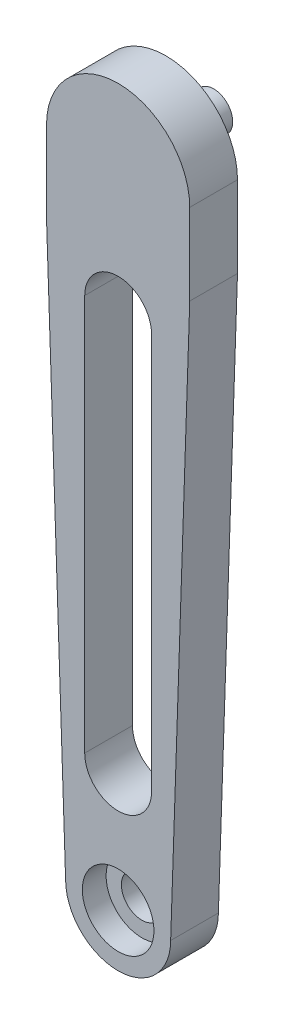
ISO-10303-21;
HEADER;
FILE_DESCRIPTION(('STEP AP214'),'2;1');
FILE_NAME('part.step','',(''),(''),'','','');
FILE_SCHEMA(('AUTOMOTIVE_DESIGN { 1 0 10303 214 1 1 1 1 }'));
ENDSEC;
DATA;
#1=APPLICATION_CONTEXT('core data for automotive mechanical design processes');
#2=APPLICATION_PROTOCOL_DEFINITION('international standard','automotive_design',2000,#1);
#3=PRODUCT_CONTEXT('',#1,'mechanical');
#4=PRODUCT('Part','Part','',(#3));
#5=PRODUCT_RELATED_PRODUCT_CATEGORY('part','',(#4));
#6=PRODUCT_DEFINITION_FORMATION('','',#4);
#7=PRODUCT_DEFINITION_CONTEXT('part definition',#1,'design');
#8=PRODUCT_DEFINITION('design','',#6,#7);
#9=PRODUCT_DEFINITION_SHAPE('','',#8);
#10=(LENGTH_UNIT() NAMED_UNIT(*) SI_UNIT(.MILLI.,.METRE.));
#11=(NAMED_UNIT(*) PLANE_ANGLE_UNIT() SI_UNIT($,.RADIAN.));
#12=(NAMED_UNIT(*) SI_UNIT($,.STERADIAN.) SOLID_ANGLE_UNIT());
#13=UNCERTAINTY_MEASURE_WITH_UNIT(LENGTH_MEASURE(1.E-05),#10,'distance_accuracy_value','');
#14=(GEOMETRIC_REPRESENTATION_CONTEXT(3) GLOBAL_UNCERTAINTY_ASSIGNED_CONTEXT((#13)) GLOBAL_UNIT_ASSIGNED_CONTEXT((#10,
#11,#12)) REPRESENTATION_CONTEXT('',''));
#15=CARTESIAN_POINT('',(0.,0.,0.));
#16=DIRECTION('',(0.,0.,1.));
#17=DIRECTION('',(1.,0.,0.));
#18=AXIS2_PLACEMENT_3D('',#15,#16,#17);
#19=CARTESIAN_POINT('',(0.,0.,10.));
#20=DIRECTION('',(0.,0.,-1.));
#21=DIRECTION('',(-1.,0.,0.));
#22=AXIS2_PLACEMENT_3D('',#19,#20,#21);
#23=CYLINDRICAL_SURFACE('',#22,7.5);
#24=CARTESIAN_POINT('',(0.,0.,10.));
#25=DIRECTION('',(0.,0.,1.));
#26=DIRECTION('',(1.,0.,0.));
#27=AXIS2_PLACEMENT_3D('',#24,#25,#26);
#28=CIRCLE('',#27,7.5);
#29=CARTESIAN_POINT('',(7.5,0.,10.));
#30=VERTEX_POINT('',#29);
#31=EDGE_CURVE('E183',#30,#30,#28,.T.);
#32=ORIENTED_EDGE('',*,*,#31,.T.);
#33=EDGE_LOOP('',(#32));
#34=FACE_BOUND('',#33,.T.);
#35=CARTESIAN_POINT('',(0.,0.,5.0216));
#36=DIRECTION('',(0.,0.,-1.));
#37=DIRECTION('',(-1.,0.,0.));
#38=AXIS2_PLACEMENT_3D('',#35,#36,#37);
#39=CIRCLE('',#38,7.5);
#40=CARTESIAN_POINT('',(-7.5,0.,5.0216));
#41=VERTEX_POINT('',#40);
#42=EDGE_CURVE('E151',#41,#41,#39,.T.);
#43=ORIENTED_EDGE('',*,*,#42,.T.);
#44=EDGE_LOOP('',(#43));
#45=FACE_BOUND('',#44,.T.);
#46=ADVANCED_FACE('F33',(#34,#45),#23,.F.);
#47=CARTESIAN_POINT('',(0.,135.,10.));
#48=DIRECTION('',(0.,0.,1.));
#49=DIRECTION('',(1.,0.,0.));
#50=AXIS2_PLACEMENT_3D('',#47,#48,#49);
#51=PLANE('',#50);
#52=DIRECTION('',(0.,-1.,0.));
#53=VECTOR('',#52,1.);
#54=CARTESIAN_POINT('',(7.00000000000001,108.,9.99999999999999));
#55=LINE('',#54,#53);
#56=CARTESIAN_POINT('',(7.00000000000001,108.,9.99999999999999));
#57=VERTEX_POINT('',#56);
#58=CARTESIAN_POINT('',(7.,25.,9.99999999999999));
#59=VERTEX_POINT('',#58);
#60=EDGE_CURVE('E124',#57,#59,#55,.T.);
#61=ORIENTED_EDGE('',*,*,#60,.T.);
#62=CARTESIAN_POINT('',(0.,25.,9.99999999999999));
#63=DIRECTION('',(0.,0.,1.));
#64=DIRECTION('',(1.,0.,0.));
#65=AXIS2_PLACEMENT_3D('',#62,#63,#64);
#66=CIRCLE('',#65,7.);
#67=CARTESIAN_POINT('',(-7.,25.,9.99999999999999));
#68=VERTEX_POINT('',#67);
#69=EDGE_CURVE('E111',#59,#68,#66,.F.);
#70=ORIENTED_EDGE('',*,*,#69,.T.);
#71=DIRECTION('',(0.,1.,0.));
#72=VECTOR('',#71,1.);
#73=CARTESIAN_POINT('',(-7.00000000000001,108.,9.99999999999999));
#74=LINE('',#73,#72);
#75=CARTESIAN_POINT('',(-7.00000000000001,108.,9.99999999999999));
#76=VERTEX_POINT('',#75);
#77=EDGE_CURVE('E142',#68,#76,#74,.T.);
#78=ORIENTED_EDGE('',*,*,#77,.T.);
#79=CARTESIAN_POINT('',(0.,108.,9.99999999999999));
#80=DIRECTION('',(0.,0.,1.));
#81=DIRECTION('',(1.,0.,0.));
#82=AXIS2_PLACEMENT_3D('',#79,#80,#81);
#83=CIRCLE('',#82,7.00000000000001);
#84=EDGE_CURVE('E132',#76,#57,#83,.F.);
#85=ORIENTED_EDGE('',*,*,#84,.T.);
#86=EDGE_LOOP('',(#61,#70,#78,#85));
#87=FACE_BOUND('',#86,.T.);
#88=DIRECTION('',(-0.0338788456657571,-0.999425947139835,0.));
#89=VECTOR('',#88,1.);
#90=CARTESIAN_POINT('',(11.,0.,10.));
#91=LINE('',#90,#89);
#92=CARTESIAN_POINT('',(15.,118.,10.));
#93=VERTEX_POINT('',#92);
#94=CARTESIAN_POINT('',(11.,0.,10.));
#95=VERTEX_POINT('',#94);
#96=EDGE_CURVE('E161',#93,#95,#91,.T.);
#97=ORIENTED_EDGE('',*,*,#96,.F.);
#98=DIRECTION('',(0.,1.,0.));
#99=VECTOR('',#98,1.);
#100=CARTESIAN_POINT('',(15.,135.,10.));
#101=LINE('',#100,#99);
#102=CARTESIAN_POINT('',(15.,135.,10.));
#103=VERTEX_POINT('',#102);
#104=EDGE_CURVE('E194',#93,#103,#101,.T.);
#105=ORIENTED_EDGE('',*,*,#104,.T.);
#106=CARTESIAN_POINT('',(0.,135.,10.));
#107=DIRECTION('',(0.,0.,1.));
#108=DIRECTION('',(1.,0.,0.));
#109=AXIS2_PLACEMENT_3D('',#106,#107,#108);
#110=CIRCLE('',#109,15.);
#111=CARTESIAN_POINT('',(-15.,135.,10.));
#112=VERTEX_POINT('',#111);
#113=EDGE_CURVE('E187',#103,#112,#110,.T.);
#114=ORIENTED_EDGE('',*,*,#113,.T.);
#115=DIRECTION('',(0.,-1.,0.));
#116=VECTOR('',#115,1.);
#117=CARTESIAN_POINT('',(-15.,135.,10.));
#118=LINE('',#117,#116);
#119=CARTESIAN_POINT('',(-15.,118.,10.));
#120=VERTEX_POINT('',#119);
#121=EDGE_CURVE('E190',#112,#120,#118,.T.);
#122=ORIENTED_EDGE('',*,*,#121,.T.);
#123=DIRECTION('',(-0.0338788456657571,0.999425947139835,0.));
#124=VECTOR('',#123,1.);
#125=CARTESIAN_POINT('',(-11.,0.,10.));
#126=LINE('',#125,#124);
#127=CARTESIAN_POINT('',(-11.,0.,10.));
#128=VERTEX_POINT('',#127);
#129=EDGE_CURVE('E159',#128,#120,#126,.T.);
#130=ORIENTED_EDGE('',*,*,#129,.F.);
#131=CARTESIAN_POINT('',(0.,0.,10.));
#132=DIRECTION('',(0.,0.,-1.));
#133=DIRECTION('',(1.,0.,0.));
#134=AXIS2_PLACEMENT_3D('',#131,#132,#133);
#135=CIRCLE('',#134,11.);
#136=EDGE_CURVE('E156',#95,#128,#135,.T.);
#137=ORIENTED_EDGE('',*,*,#136,.F.);
#138=EDGE_LOOP('',(#97,#105,#114,#122,#130,#137));
#139=FACE_BOUND('',#138,.T.);
#140=ORIENTED_EDGE('',*,*,#31,.F.);
#141=EDGE_LOOP('',(#140));
#142=FACE_BOUND('',#141,.T.);
#143=ADVANCED_FACE('F130',(#87,#139,#142),#51,.T.);
#144=CARTESIAN_POINT('',(0.,135.,0.));
#145=DIRECTION('',(0.,0.,1.));
#146=DIRECTION('',(1.,0.,0.));
#147=AXIS2_PLACEMENT_3D('',#144,#145,#146);
#148=PLANE('',#147);
#149=CARTESIAN_POINT('',(0.,25.,0.));
#150=DIRECTION('',(0.,0.,-1.));
#151=DIRECTION('',(-1.,0.,0.));
#152=AXIS2_PLACEMENT_3D('',#149,#150,#151);
#153=CIRCLE('',#152,7.);
#154=CARTESIAN_POINT('',(7.,25.,0.));
#155=VERTEX_POINT('',#154);
#156=CARTESIAN_POINT('',(-7.,25.,0.));
#157=VERTEX_POINT('',#156);
#158=EDGE_CURVE('E134',#155,#157,#153,.T.);
#159=ORIENTED_EDGE('',*,*,#158,.F.);
#160=DIRECTION('',(0.,-1.,0.));
#161=VECTOR('',#160,1.);
#162=CARTESIAN_POINT('',(7.00000000000001,108.,0.));
#163=LINE('',#162,#161);
#164=CARTESIAN_POINT('',(7.00000000000001,108.,0.));
#165=VERTEX_POINT('',#164);
#166=EDGE_CURVE('E127',#165,#155,#163,.T.);
#167=ORIENTED_EDGE('',*,*,#166,.F.);
#168=CARTESIAN_POINT('',(0.,108.,0.));
#169=DIRECTION('',(0.,0.,-1.));
#170=DIRECTION('',(-1.,0.,0.));
#171=AXIS2_PLACEMENT_3D('',#168,#169,#170);
#172=CIRCLE('',#171,7.00000000000001);
#173=CARTESIAN_POINT('',(-7.00000000000001,108.,0.));
#174=VERTEX_POINT('',#173);
#175=EDGE_CURVE('E138',#174,#165,#172,.T.);
#176=ORIENTED_EDGE('',*,*,#175,.F.);
#177=DIRECTION('',(0.,1.,0.));
#178=VECTOR('',#177,1.);
#179=CARTESIAN_POINT('',(-7.00000000000001,108.,0.));
#180=LINE('',#179,#178);
#181=EDGE_CURVE('E56',#157,#174,#180,.T.);
#182=ORIENTED_EDGE('',*,*,#181,.F.);
#183=EDGE_LOOP('',(#159,#167,#176,#182));
#184=FACE_BOUND('',#183,.T.);
#185=DIRECTION('',(0.,1.,0.));
#186=VECTOR('',#185,1.);
#187=CARTESIAN_POINT('',(15.,135.,0.));
#188=LINE('',#187,#186);
#189=CARTESIAN_POINT('',(15.,118.,0.));
#190=VERTEX_POINT('',#189);
#191=CARTESIAN_POINT('',(15.,135.,0.));
#192=VERTEX_POINT('',#191);
#193=EDGE_CURVE('E191',#190,#192,#188,.T.);
#194=ORIENTED_EDGE('',*,*,#193,.F.);
#195=DIRECTION('',(-0.0338788456657571,-0.999425947139835,0.));
#196=VECTOR('',#195,1.);
#197=CARTESIAN_POINT('',(15.5583931133429,134.472596843616,0.));
#198=LINE('',#197,#196);
#199=CARTESIAN_POINT('',(11.,0.,0.));
#200=VERTEX_POINT('',#199);
#201=EDGE_CURVE('E167',#190,#200,#198,.T.);
#202=ORIENTED_EDGE('',*,*,#201,.T.);
#203=CARTESIAN_POINT('',(0.,0.,0.));
#204=DIRECTION('',(0.,0.,1.));
#205=DIRECTION('',(1.,0.,0.));
#206=AXIS2_PLACEMENT_3D('',#203,#204,#205);
#207=CIRCLE('',#206,11.);
#208=CARTESIAN_POINT('',(-11.,0.,0.));
#209=VERTEX_POINT('',#208);
#210=EDGE_CURVE('E11',#200,#209,#207,.F.);
#211=ORIENTED_EDGE('',*,*,#210,.T.);
#212=DIRECTION('',(-0.0338788456657571,0.999425947139835,0.));
#213=VECTOR('',#212,1.);
#214=CARTESIAN_POINT('',(-15.5583931133429,134.472596843616,0.));
#215=LINE('',#214,#213);
#216=CARTESIAN_POINT('',(-15.,118.,0.));
#217=VERTEX_POINT('',#216);
#218=EDGE_CURVE('E174',#209,#217,#215,.T.);
#219=ORIENTED_EDGE('',*,*,#218,.T.);
#220=DIRECTION('',(0.,-1.,0.));
#221=VECTOR('',#220,1.);
#222=CARTESIAN_POINT('',(-15.,135.,0.));
#223=LINE('',#222,#221);
#224=CARTESIAN_POINT('',(-15.,135.,0.));
#225=VERTEX_POINT('',#224);
#226=EDGE_CURVE('E199',#225,#217,#223,.T.);
#227=ORIENTED_EDGE('',*,*,#226,.F.);
#228=CARTESIAN_POINT('',(0.,135.,0.));
#229=DIRECTION('',(0.,0.,1.));
#230=DIRECTION('',(1.,0.,0.));
#231=AXIS2_PLACEMENT_3D('',#228,#229,#230);
#232=CIRCLE('',#231,15.);
#233=EDGE_CURVE('E186',#192,#225,#232,.T.);
#234=ORIENTED_EDGE('',*,*,#233,.F.);
#235=EDGE_LOOP('',(#194,#202,#211,#219,#227,#234));
#236=FACE_BOUND('',#235,.T.);
#237=CARTESIAN_POINT('',(0.,135.,0.));
#238=DIRECTION('',(0.,0.,-1.));
#239=DIRECTION('',(-1.,0.,0.));
#240=AXIS2_PLACEMENT_3D('',#237,#238,#239);
#241=CIRCLE('',#240,4.);
#242=CARTESIAN_POINT('',(-4.,135.,0.));
#243=VERTEX_POINT('',#242);
#244=EDGE_CURVE('E180',#243,#243,#241,.T.);
#245=ORIENTED_EDGE('',*,*,#244,.F.);
#246=EDGE_LOOP('',(#245));
#247=FACE_BOUND('',#246,.T.);
#248=CARTESIAN_POINT('',(0.,0.,0.));
#249=DIRECTION('',(0.,0.,-1.));
#250=DIRECTION('',(-1.,0.,0.));
#251=AXIS2_PLACEMENT_3D('',#248,#249,#250);
#252=CIRCLE('',#251,4.3);
#253=CARTESIAN_POINT('',(-4.3,0.,0.));
#254=VERTEX_POINT('',#253);
#255=EDGE_CURVE('E147',#254,#254,#252,.T.);
#256=ORIENTED_EDGE('',*,*,#255,.F.);
#257=EDGE_LOOP('',(#256));
#258=FACE_BOUND('',#257,.T.);
#259=ADVANCED_FACE('F217',(#184,#236,#247,#258),#148,.F.);
#260=CARTESIAN_POINT('',(0.,135.,10.));
#261=DIRECTION('',(0.,0.,-1.));
#262=DIRECTION('',(-1.,0.,0.));
#263=AXIS2_PLACEMENT_3D('',#260,#261,#262);
#264=CYLINDRICAL_SURFACE('',#263,15.);
#265=ORIENTED_EDGE('',*,*,#233,.T.);
#266=DIRECTION('',(0.,0.,-1.));
#267=VECTOR('',#266,1.);
#268=CARTESIAN_POINT('',(-15.,135.,10.));
#269=LINE('',#268,#267);
#270=EDGE_CURVE('E205',#112,#225,#269,.T.);
#271=ORIENTED_EDGE('',*,*,#270,.F.);
#272=ORIENTED_EDGE('',*,*,#113,.F.);
#273=DIRECTION('',(0.,0.,-1.));
#274=VECTOR('',#273,1.);
#275=CARTESIAN_POINT('',(15.,135.,10.));
#276=LINE('',#275,#274);
#277=EDGE_CURVE('E196',#103,#192,#276,.T.);
#278=ORIENTED_EDGE('',*,*,#277,.T.);
#279=EDGE_LOOP('',(#265,#271,#272,#278));
#280=FACE_BOUND('',#279,.T.);
#281=ADVANCED_FACE('F35',(#280),#264,.T.);
#282=CARTESIAN_POINT('',(-15.,135.,10.));
#283=DIRECTION('',(1.,0.,0.));
#284=DIRECTION('',(0.,1.,0.));
#285=AXIS2_PLACEMENT_3D('',#282,#283,#284);
#286=PLANE('',#285);
#287=ORIENTED_EDGE('',*,*,#226,.T.);
#288=DIRECTION('',(0.,0.,1.));
#289=VECTOR('',#288,1.);
#290=CARTESIAN_POINT('',(-15.,118.,-10.));
#291=LINE('',#290,#289);
#292=EDGE_CURVE('E168',#217,#120,#291,.T.);
#293=ORIENTED_EDGE('',*,*,#292,.T.);
#294=ORIENTED_EDGE('',*,*,#121,.F.);
#295=ORIENTED_EDGE('',*,*,#270,.T.);
#296=EDGE_LOOP('',(#287,#293,#294,#295));
#297=FACE_BOUND('',#296,.T.);
#298=ADVANCED_FACE('F232',(#297),#286,.F.);
#299=CARTESIAN_POINT('',(15.,135.,10.));
#300=DIRECTION('',(-1.,0.,0.));
#301=DIRECTION('',(0.,-1.,0.));
#302=AXIS2_PLACEMENT_3D('',#299,#300,#301);
#303=PLANE('',#302);
#304=ORIENTED_EDGE('',*,*,#104,.F.);
#305=DIRECTION('',(0.,0.,-1.));
#306=VECTOR('',#305,1.);
#307=CARTESIAN_POINT('',(15.,118.,10.));
#308=LINE('',#307,#306);
#309=EDGE_CURVE('E41',#93,#190,#308,.T.);
#310=ORIENTED_EDGE('',*,*,#309,.T.);
#311=ORIENTED_EDGE('',*,*,#193,.T.);
#312=ORIENTED_EDGE('',*,*,#277,.F.);
#313=EDGE_LOOP('',(#304,#310,#311,#312));
#314=FACE_BOUND('',#313,.T.);
#315=ADVANCED_FACE('F211',(#314),#303,.F.);
#316=CARTESIAN_POINT('',(0.,135.,-10.));
#317=DIRECTION('',(0.,0.,1.));
#318=DIRECTION('',(1.,0.,0.));
#319=AXIS2_PLACEMENT_3D('',#316,#317,#318);
#320=CYLINDRICAL_SURFACE('',#319,4.);
#321=CARTESIAN_POINT('',(0.,135.,-10.));
#322=DIRECTION('',(0.,0.,1.));
#323=DIRECTION('',(1.,0.,0.));
#324=AXIS2_PLACEMENT_3D('',#321,#322,#323);
#325=CIRCLE('',#324,4.);
#326=CARTESIAN_POINT('',(4.,135.,-10.));
#327=VERTEX_POINT('',#326);
#328=EDGE_CURVE('E177',#327,#327,#325,.T.);
#329=ORIENTED_EDGE('',*,*,#328,.T.);
#330=EDGE_LOOP('',(#329));
#331=FACE_BOUND('',#330,.T.);
#332=ORIENTED_EDGE('',*,*,#244,.T.);
#333=EDGE_LOOP('',(#332));
#334=FACE_BOUND('',#333,.T.);
#335=ADVANCED_FACE('F255',(#331,#334),#320,.T.);
#336=CARTESIAN_POINT('',(0.,135.,-10.));
#337=DIRECTION('',(0.,0.,1.));
#338=DIRECTION('',(1.,0.,0.));
#339=AXIS2_PLACEMENT_3D('',#336,#337,#338);
#340=PLANE('',#339);
#341=ORIENTED_EDGE('',*,*,#328,.F.);
#342=EDGE_LOOP('',(#341));
#343=FACE_BOUND('',#342,.T.);
#344=ADVANCED_FACE('F242',(#343),#340,.F.);
#345=CARTESIAN_POINT('',(0.,0.,-10.));
#346=DIRECTION('',(0.,0.,1.));
#347=DIRECTION('',(1.,0.,0.));
#348=AXIS2_PLACEMENT_3D('',#345,#346,#347);
#349=CYLINDRICAL_SURFACE('',#348,11.);
#350=DIRECTION('',(0.,0.,1.));
#351=VECTOR('',#350,1.);
#352=CARTESIAN_POINT('',(11.,0.,-10.));
#353=LINE('',#352,#351);
#354=EDGE_CURVE('E165',#200,#95,#353,.T.);
#355=ORIENTED_EDGE('',*,*,#354,.T.);
#356=ORIENTED_EDGE('',*,*,#136,.T.);
#357=DIRECTION('',(0.,0.,1.));
#358=VECTOR('',#357,1.);
#359=CARTESIAN_POINT('',(-11.,0.,-10.));
#360=LINE('',#359,#358);
#361=EDGE_CURVE('E164',#209,#128,#360,.T.);
#362=ORIENTED_EDGE('',*,*,#361,.F.);
#363=ORIENTED_EDGE('',*,*,#210,.F.);
#364=EDGE_LOOP('',(#355,#356,#362,#363));
#365=FACE_BOUND('',#364,.T.);
#366=ADVANCED_FACE('F228',(#365),#349,.T.);
#367=CARTESIAN_POINT('',(-11.,0.,-10.));
#368=DIRECTION('',(0.999425947139835,0.0338788456657571,0.));
#369=DIRECTION('',(-0.0338788456657571,0.999425947139835,0.));
#370=AXIS2_PLACEMENT_3D('',#367,#368,#369);
#371=PLANE('',#370);
#372=ORIENTED_EDGE('',*,*,#361,.T.);
#373=ORIENTED_EDGE('',*,*,#129,.T.);
#374=ORIENTED_EDGE('',*,*,#292,.F.);
#375=ORIENTED_EDGE('',*,*,#218,.F.);
#376=EDGE_LOOP('',(#372,#373,#374,#375));
#377=FACE_BOUND('',#376,.T.);
#378=ADVANCED_FACE('F233',(#377),#371,.F.);
#379=CARTESIAN_POINT('',(11.,0.,-10.));
#380=DIRECTION('',(-0.999425947139835,0.0338788456657571,0.));
#381=DIRECTION('',(-0.0338788456657571,-0.999425947139835,0.));
#382=AXIS2_PLACEMENT_3D('',#379,#380,#381);
#383=PLANE('',#382);
#384=ORIENTED_EDGE('',*,*,#309,.F.);
#385=ORIENTED_EDGE('',*,*,#96,.T.);
#386=ORIENTED_EDGE('',*,*,#354,.F.);
#387=ORIENTED_EDGE('',*,*,#201,.F.);
#388=EDGE_LOOP('',(#384,#385,#386,#387));
#389=FACE_BOUND('',#388,.T.);
#390=ADVANCED_FACE('F226',(#389),#383,.F.);
#391=CARTESIAN_POINT('',(0.,0.,5.0216));
#392=DIRECTION('',(0.,0.,-1.));
#393=DIRECTION('',(-1.,0.,0.));
#394=AXIS2_PLACEMENT_3D('',#391,#392,#393);
#395=PLANE('',#394);
#396=CARTESIAN_POINT('',(0.,0.,5.0216));
#397=DIRECTION('',(0.,0.,-1.));
#398=DIRECTION('',(-1.,0.,0.));
#399=AXIS2_PLACEMENT_3D('',#396,#397,#398);
#400=CIRCLE('',#399,4.3);
#401=CARTESIAN_POINT('',(-4.3,0.,5.0216));
#402=VERTEX_POINT('',#401);
#403=EDGE_CURVE('E148',#402,#402,#400,.T.);
#404=ORIENTED_EDGE('',*,*,#403,.T.);
#405=EDGE_LOOP('',(#404));
#406=FACE_BOUND('',#405,.T.);
#407=ORIENTED_EDGE('',*,*,#42,.F.);
#408=EDGE_LOOP('',(#407));
#409=FACE_BOUND('',#408,.T.);
#410=ADVANCED_FACE('F240',(#406,#409),#395,.F.);
#411=CARTESIAN_POINT('',(0.,0.,5.0216));
#412=DIRECTION('',(0.,0.,-1.));
#413=DIRECTION('',(-1.,0.,0.));
#414=AXIS2_PLACEMENT_3D('',#411,#412,#413);
#415=CYLINDRICAL_SURFACE('',#414,4.3);
#416=ORIENTED_EDGE('',*,*,#403,.F.);
#417=EDGE_LOOP('',(#416));
#418=FACE_BOUND('',#417,.T.);
#419=ORIENTED_EDGE('',*,*,#255,.T.);
#420=EDGE_LOOP('',(#419));
#421=FACE_BOUND('',#420,.T.);
#422=ADVANCED_FACE('F331',(#418,#421),#415,.F.);
#423=CARTESIAN_POINT('',(7.00000000000001,108.,108.005101908013));
#424=DIRECTION('',(1.,0.,0.));
#425=DIRECTION('',(0.,1.,0.));
#426=AXIS2_PLACEMENT_3D('',#423,#424,#425);
#427=PLANE('',#426);
#428=DIRECTION('',(0.,0.,-1.));
#429=VECTOR('',#428,1.);
#430=CARTESIAN_POINT('',(7.00000000000001,108.,108.005101908013));
#431=LINE('',#430,#429);
#432=EDGE_CURVE('E48',#57,#165,#431,.T.);
#433=ORIENTED_EDGE('',*,*,#432,.T.);
#434=ORIENTED_EDGE('',*,*,#166,.T.);
#435=DIRECTION('',(0.,0.,-1.));
#436=VECTOR('',#435,1.);
#437=CARTESIAN_POINT('',(7.,25.,108.005101908013));
#438=LINE('',#437,#436);
#439=EDGE_CURVE('E115',#59,#155,#438,.T.);
#440=ORIENTED_EDGE('',*,*,#439,.F.);
#441=ORIENTED_EDGE('',*,*,#60,.F.);
#442=EDGE_LOOP('',(#433,#434,#440,#441));
#443=FACE_BOUND('',#442,.T.);
#444=ADVANCED_FACE('F123',(#443),#427,.F.);
#445=CARTESIAN_POINT('',(0.,25.,108.005101908013));
#446=DIRECTION('',(0.,0.,-1.));
#447=DIRECTION('',(-1.,0.,0.));
#448=AXIS2_PLACEMENT_3D('',#445,#446,#447);
#449=CYLINDRICAL_SURFACE('',#448,7.);
#450=ORIENTED_EDGE('',*,*,#439,.T.);
#451=ORIENTED_EDGE('',*,*,#158,.T.);
#452=DIRECTION('',(0.,0.,-1.));
#453=VECTOR('',#452,1.);
#454=CARTESIAN_POINT('',(-7.,25.,108.005101908013));
#455=LINE('',#454,#453);
#456=EDGE_CURVE('E117',#68,#157,#455,.T.);
#457=ORIENTED_EDGE('',*,*,#456,.F.);
#458=ORIENTED_EDGE('',*,*,#69,.F.);
#459=EDGE_LOOP('',(#450,#451,#457,#458));
#460=FACE_BOUND('',#459,.T.);
#461=ADVANCED_FACE('F113',(#460),#449,.F.);
#462=CARTESIAN_POINT('',(-7.00000000000001,108.,108.005101908013));
#463=DIRECTION('',(-1.,0.,0.));
#464=DIRECTION('',(0.,-1.,0.));
#465=AXIS2_PLACEMENT_3D('',#462,#463,#464);
#466=PLANE('',#465);
#467=ORIENTED_EDGE('',*,*,#456,.T.);
#468=ORIENTED_EDGE('',*,*,#181,.T.);
#469=DIRECTION('',(0.,0.,-1.));
#470=VECTOR('',#469,1.);
#471=CARTESIAN_POINT('',(-7.00000000000001,108.,108.005101908013));
#472=LINE('',#471,#470);
#473=EDGE_CURVE('E141',#76,#174,#472,.T.);
#474=ORIENTED_EDGE('',*,*,#473,.F.);
#475=ORIENTED_EDGE('',*,*,#77,.F.);
#476=EDGE_LOOP('',(#467,#468,#474,#475));
#477=FACE_BOUND('',#476,.T.);
#478=ADVANCED_FACE('F349',(#477),#466,.F.);
#479=CARTESIAN_POINT('',(0.,108.,108.005101908013));
#480=DIRECTION('',(0.,0.,-1.));
#481=DIRECTION('',(-1.,0.,0.));
#482=AXIS2_PLACEMENT_3D('',#479,#480,#481);
#483=CYLINDRICAL_SURFACE('',#482,7.00000000000001);
#484=ORIENTED_EDGE('',*,*,#473,.T.);
#485=ORIENTED_EDGE('',*,*,#175,.T.);
#486=ORIENTED_EDGE('',*,*,#432,.F.);
#487=ORIENTED_EDGE('',*,*,#84,.F.);
#488=EDGE_LOOP('',(#484,#485,#486,#487));
#489=FACE_BOUND('',#488,.T.);
#490=ADVANCED_FACE('F356',(#489),#483,.F.);
#491=CLOSED_SHELL('',(#46,#143,#259,#281,#298,#315,#335,#344,#366,#378,#390,#410,#422,#444,#461,
#478,#490));
#492=MANIFOLD_SOLID_BREP('B2',#491);
#493=ADVANCED_BREP_SHAPE_REPRESENTATION('',(#18,#492),#14);
#494=SHAPE_DEFINITION_REPRESENTATION(#9,#493);
ENDSEC;
END-ISO-10303-21;
